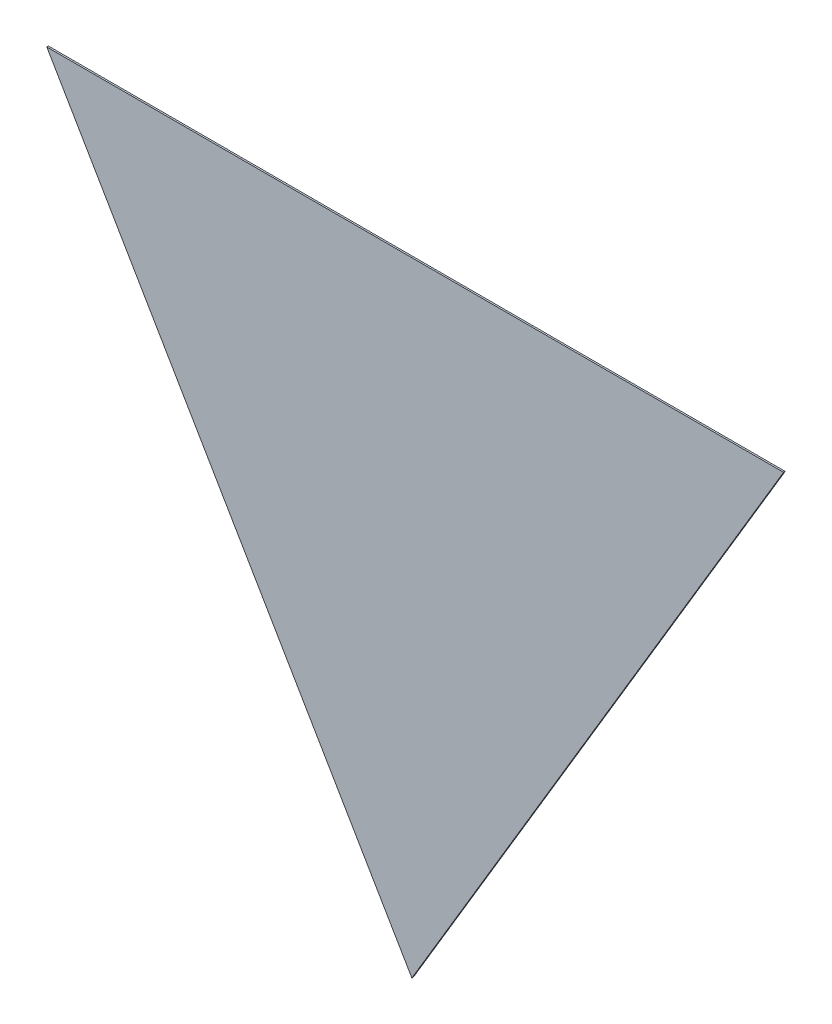
ISO-10303-21;
HEADER;
FILE_DESCRIPTION(('STEP AP214'),'2;1');
FILE_NAME('part.step','',(''),(''),'','','');
FILE_SCHEMA(('AUTOMOTIVE_DESIGN { 1 0 10303 214 1 1 1 1 }'));
ENDSEC;
DATA;
#1=APPLICATION_CONTEXT('core data for automotive mechanical design processes');
#2=APPLICATION_PROTOCOL_DEFINITION('international standard','automotive_design',2000,#1);
#3=PRODUCT_CONTEXT('',#1,'mechanical');
#4=PRODUCT('Part','Part','',(#3));
#5=PRODUCT_RELATED_PRODUCT_CATEGORY('part','',(#4));
#6=PRODUCT_DEFINITION_FORMATION('','',#4);
#7=PRODUCT_DEFINITION_CONTEXT('part definition',#1,'design');
#8=PRODUCT_DEFINITION('design','',#6,#7);
#9=PRODUCT_DEFINITION_SHAPE('','',#8);
#10=(LENGTH_UNIT() NAMED_UNIT(*) SI_UNIT(.MILLI.,.METRE.));
#11=(NAMED_UNIT(*) PLANE_ANGLE_UNIT() SI_UNIT($,.RADIAN.));
#12=(NAMED_UNIT(*) SI_UNIT($,.STERADIAN.) SOLID_ANGLE_UNIT());
#13=UNCERTAINTY_MEASURE_WITH_UNIT(LENGTH_MEASURE(1.E-05),#10,'distance_accuracy_value','');
#14=(GEOMETRIC_REPRESENTATION_CONTEXT(3) GLOBAL_UNCERTAINTY_ASSIGNED_CONTEXT((#13)) GLOBAL_UNIT_ASSIGNED_CONTEXT((#10,
#11,#12)) REPRESENTATION_CONTEXT('',''));
#15=CARTESIAN_POINT('',(0.,0.,0.));
#16=DIRECTION('',(0.,0.,1.));
#17=DIRECTION('',(1.,0.,0.));
#18=AXIS2_PLACEMENT_3D('',#15,#16,#17);
#19=CARTESIAN_POINT('',(-0.0285812192739959,0.867422513567,0.00015));
#20=DIRECTION('',(0.859023340627718,-0.511936422084614,0.));
#21=DIRECTION('',(0.,0.,-1.));
#22=AXIS2_PLACEMENT_3D('',#19,#20,#21);
#23=PLANE('',#22);
#24=DIRECTION('',(0.,0.,1.));
#25=VECTOR('',#24,1.);
#26=CARTESIAN_POINT('',(-0.0116133959156502,0.89589432310365,0.));
#27=LINE('',#26,#25);
#28=CARTESIAN_POINT('',(-0.0116133959156502,0.89589432310365,0.));
#29=VERTEX_POINT('',#28);
#30=CARTESIAN_POINT('',(-0.0116133959156502,0.89589432310365,0.00015));
#31=VERTEX_POINT('',#30);
#32=EDGE_CURVE('E11',#29,#31,#27,.T.);
#33=ORIENTED_EDGE('',*,*,#32,.T.);
#34=DIRECTION('',(-0.511936422084614,-0.859023340627718,0.));
#35=VECTOR('',#34,1.);
#36=CARTESIAN_POINT('',(-0.0116133959156502,0.89589432310365,0.00015));
#37=LINE('',#36,#35);
#38=CARTESIAN_POINT('',(-0.0455490426323417,0.83895070403035,0.00015));
#39=VERTEX_POINT('',#38);
#40=EDGE_CURVE('E24',#31,#39,#37,.T.);
#41=ORIENTED_EDGE('',*,*,#40,.T.);
#42=DIRECTION('',(0.,0.,1.));
#43=VECTOR('',#42,1.);
#44=CARTESIAN_POINT('',(-0.0455490426323417,0.83895070403035,0.));
#45=LINE('',#44,#43);
#46=CARTESIAN_POINT('',(-0.0455490426323417,0.83895070403035,0.));
#47=VERTEX_POINT('',#46);
#48=EDGE_CURVE('E71',#47,#39,#45,.T.);
#49=ORIENTED_EDGE('',*,*,#48,.F.);
#50=DIRECTION('',(-0.511936422084614,-0.859023340627718,0.));
#51=VECTOR('',#50,1.);
#52=CARTESIAN_POINT('',(-0.0116133959156502,0.89589432310365,0.));
#53=LINE('',#52,#51);
#54=EDGE_CURVE('E62',#29,#47,#53,.T.);
#55=ORIENTED_EDGE('',*,*,#54,.F.);
#56=EDGE_LOOP('',(#33,#41,#49,#55));
#57=FACE_BOUND('',#56,.T.);
#58=ADVANCED_FACE('F17',(#57),#23,.T.);
#59=CARTESIAN_POINT('',(-0.0622121167906709,0.867422513567,0.00015));
#60=DIRECTION('',(-0.863058750862992,-0.505103546373229,0.));
#61=DIRECTION('',(0.,0.,1.));
#62=AXIS2_PLACEMENT_3D('',#59,#60,#61);
#63=PLANE('',#62);
#64=ORIENTED_EDGE('',*,*,#48,.T.);
#65=DIRECTION('',(-0.505103546373229,0.863058750862991,0.));
#66=VECTOR('',#65,1.);
#67=CARTESIAN_POINT('',(-0.0455490426323417,0.83895070403035,0.00015));
#68=LINE('',#67,#66);
#69=CARTESIAN_POINT('',(-0.0788751909490002,0.89589432310365,0.00015));
#70=VERTEX_POINT('',#69);
#71=EDGE_CURVE('E54',#39,#70,#68,.T.);
#72=ORIENTED_EDGE('',*,*,#71,.T.);
#73=DIRECTION('',(0.,0.,1.));
#74=VECTOR('',#73,1.);
#75=CARTESIAN_POINT('',(-0.0788751909490002,0.89589432310365,0.));
#76=LINE('',#75,#74);
#77=CARTESIAN_POINT('',(-0.0788751909490002,0.89589432310365,0.));
#78=VERTEX_POINT('',#77);
#79=EDGE_CURVE('E48',#78,#70,#76,.T.);
#80=ORIENTED_EDGE('',*,*,#79,.F.);
#81=DIRECTION('',(-0.505103546373229,0.863058750862991,0.));
#82=VECTOR('',#81,1.);
#83=CARTESIAN_POINT('',(-0.0455490426323417,0.83895070403035,0.));
#84=LINE('',#83,#82);
#85=EDGE_CURVE('E52',#47,#78,#84,.T.);
#86=ORIENTED_EDGE('',*,*,#85,.F.);
#87=EDGE_LOOP('',(#64,#72,#80,#86));
#88=FACE_BOUND('',#87,.T.);
#89=ADVANCED_FACE('F51',(#88),#63,.T.);
#90=CARTESIAN_POINT('',(-0.0452442934323252,0.89589432310365,0.00015));
#91=DIRECTION('',(0.,1.,0.));
#92=DIRECTION('',(0.,0.,1.));
#93=AXIS2_PLACEMENT_3D('',#90,#91,#92);
#94=PLANE('',#93);
#95=ORIENTED_EDGE('',*,*,#79,.T.);
#96=DIRECTION('',(1.,0.,0.));
#97=VECTOR('',#96,1.);
#98=CARTESIAN_POINT('',(-0.0788751909490002,0.89589432310365,0.00015));
#99=LINE('',#98,#97);
#100=EDGE_CURVE('E63',#70,#31,#99,.T.);
#101=ORIENTED_EDGE('',*,*,#100,.T.);
#102=ORIENTED_EDGE('',*,*,#32,.F.);
#103=DIRECTION('',(1.,0.,0.));
#104=VECTOR('',#103,1.);
#105=CARTESIAN_POINT('',(-0.0788751909490002,0.89589432310365,0.));
#106=LINE('',#105,#104);
#107=EDGE_CURVE('E61',#78,#29,#106,.T.);
#108=ORIENTED_EDGE('',*,*,#107,.F.);
#109=EDGE_LOOP('',(#95,#101,#102,#108));
#110=FACE_BOUND('',#109,.T.);
#111=ADVANCED_FACE('F65',(#110),#94,.T.);
#112=CARTESIAN_POINT('',(-0.0452442934323252,0.83895070403035,0.));
#113=DIRECTION('',(0.,0.,1.));
#114=DIRECTION('',(1.,0.,0.));
#115=AXIS2_PLACEMENT_3D('',#112,#113,#114);
#116=PLANE('',#115);
#117=ORIENTED_EDGE('',*,*,#54,.T.);
#118=ORIENTED_EDGE('',*,*,#85,.T.);
#119=ORIENTED_EDGE('',*,*,#107,.T.);
#120=EDGE_LOOP('',(#117,#118,#119));
#121=FACE_BOUND('',#120,.T.);
#122=ADVANCED_FACE('F60',(#121),#116,.F.);
#123=CARTESIAN_POINT('',(-0.0452442934323252,0.83895070403035,0.00015));
#124=DIRECTION('',(0.,0.,1.));
#125=DIRECTION('',(1.,0.,0.));
#126=AXIS2_PLACEMENT_3D('',#123,#124,#125);
#127=PLANE('',#126);
#128=ORIENTED_EDGE('',*,*,#40,.F.);
#129=ORIENTED_EDGE('',*,*,#100,.F.);
#130=ORIENTED_EDGE('',*,*,#71,.F.);
#131=EDGE_LOOP('',(#128,#129,#130));
#132=FACE_BOUND('',#131,.T.);
#133=ADVANCED_FACE('F73',(#132),#127,.T.);
#134=CLOSED_SHELL('',(#58,#89,#111,#122,#133));
#135=MANIFOLD_SOLID_BREP('B1',#134);
#136=ADVANCED_BREP_SHAPE_REPRESENTATION('',(#18,#135),#14);
#137=SHAPE_DEFINITION_REPRESENTATION(#9,#136);
ENDSEC;
END-ISO-10303-21;
